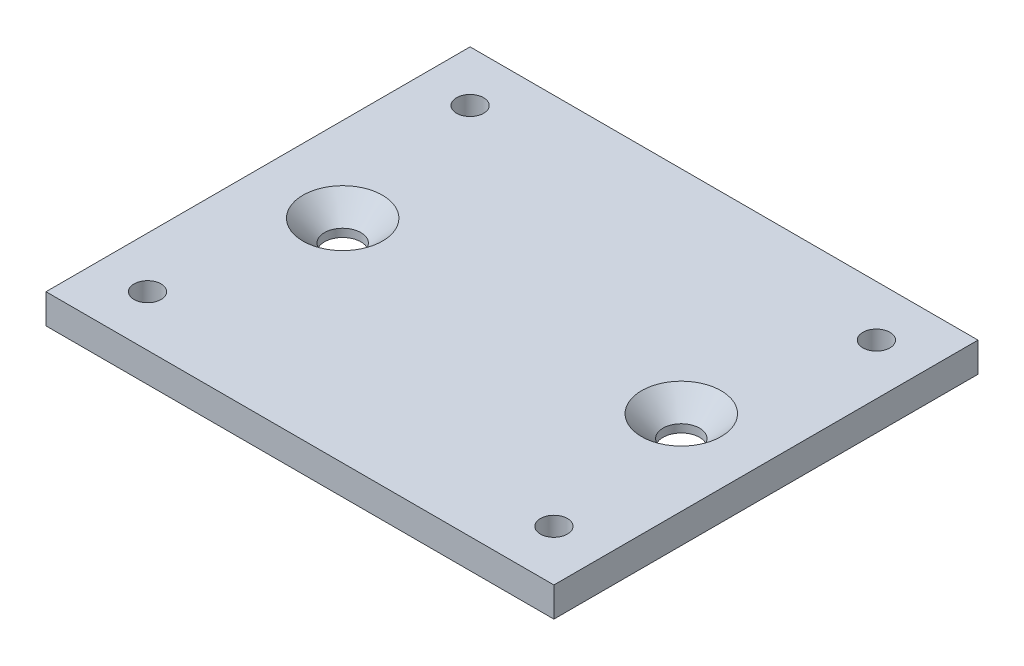
ISO-10303-21;
HEADER;
FILE_DESCRIPTION(('STEP AP214'),'2;1');
FILE_NAME('part.step','',(''),(''),'','','');
FILE_SCHEMA(('AUTOMOTIVE_DESIGN { 1 0 10303 214 1 1 1 1 }'));
ENDSEC;
DATA;
#1=APPLICATION_CONTEXT('core data for automotive mechanical design processes');
#2=APPLICATION_PROTOCOL_DEFINITION('international standard','automotive_design',2000,#1);
#3=PRODUCT_CONTEXT('',#1,'mechanical');
#4=PRODUCT('Part','Part','',(#3));
#5=PRODUCT_RELATED_PRODUCT_CATEGORY('part','',(#4));
#6=PRODUCT_DEFINITION_FORMATION('','',#4);
#7=PRODUCT_DEFINITION_CONTEXT('part definition',#1,'design');
#8=PRODUCT_DEFINITION('design','',#6,#7);
#9=PRODUCT_DEFINITION_SHAPE('','',#8);
#10=(LENGTH_UNIT() NAMED_UNIT(*) SI_UNIT(.MILLI.,.METRE.));
#11=(NAMED_UNIT(*) PLANE_ANGLE_UNIT() SI_UNIT($,.RADIAN.));
#12=(NAMED_UNIT(*) SI_UNIT($,.STERADIAN.) SOLID_ANGLE_UNIT());
#13=UNCERTAINTY_MEASURE_WITH_UNIT(LENGTH_MEASURE(1.E-05),#10,'distance_accuracy_value','');
#14=(GEOMETRIC_REPRESENTATION_CONTEXT(3) GLOBAL_UNCERTAINTY_ASSIGNED_CONTEXT((#13)) GLOBAL_UNIT_ASSIGNED_CONTEXT((#10,
#11,#12)) REPRESENTATION_CONTEXT('',''));
#15=CARTESIAN_POINT('',(0.,0.,0.));
#16=DIRECTION('',(0.,0.,1.));
#17=DIRECTION('',(1.,0.,0.));
#18=AXIS2_PLACEMENT_3D('',#15,#16,#17);
#19=CARTESIAN_POINT('',(30.,3.5,0.));
#20=DIRECTION('',(1.,0.,0.));
#21=DIRECTION('',(0.,0.,-1.));
#22=AXIS2_PLACEMENT_3D('',#19,#20,#21);
#23=PLANE('',#22);
#24=DIRECTION('',(0.,0.,1.));
#25=VECTOR('',#24,1.);
#26=CARTESIAN_POINT('',(30.,0.,0.));
#27=LINE('',#26,#25);
#28=CARTESIAN_POINT('',(30.,0.,-25.05));
#29=VERTEX_POINT('',#28);
#30=CARTESIAN_POINT('',(30.,0.,25.05));
#31=VERTEX_POINT('',#30);
#32=EDGE_CURVE('E97',#29,#31,#27,.T.);
#33=ORIENTED_EDGE('',*,*,#32,.F.);
#34=DIRECTION('',(0.,-1.,0.));
#35=VECTOR('',#34,1.);
#36=CARTESIAN_POINT('',(30.,3.5,-25.05));
#37=LINE('',#36,#35);
#38=CARTESIAN_POINT('',(30.,3.5,-25.05));
#39=VERTEX_POINT('',#38);
#40=EDGE_CURVE('E11',#39,#29,#37,.T.);
#41=ORIENTED_EDGE('',*,*,#40,.F.);
#42=DIRECTION('',(0.,0.,1.));
#43=VECTOR('',#42,1.);
#44=CARTESIAN_POINT('',(30.,3.5,0.));
#45=LINE('',#44,#43);
#46=CARTESIAN_POINT('',(30.,3.5,25.05));
#47=VERTEX_POINT('',#46);
#48=EDGE_CURVE('E89',#39,#47,#45,.T.);
#49=ORIENTED_EDGE('',*,*,#48,.T.);
#50=DIRECTION('',(0.,-1.,0.));
#51=VECTOR('',#50,1.);
#52=CARTESIAN_POINT('',(30.,3.5,25.05));
#53=LINE('',#52,#51);
#54=EDGE_CURVE('E50',#47,#31,#53,.T.);
#55=ORIENTED_EDGE('',*,*,#54,.T.);
#56=EDGE_LOOP('',(#33,#41,#49,#55));
#57=FACE_BOUND('',#56,.T.);
#58=ADVANCED_FACE('F34',(#57),#23,.T.);
#59=CARTESIAN_POINT('',(0.,3.5,-25.05));
#60=DIRECTION('',(0.,0.,-1.));
#61=DIRECTION('',(-1.,0.,0.));
#62=AXIS2_PLACEMENT_3D('',#59,#60,#61);
#63=PLANE('',#62);
#64=DIRECTION('',(1.,0.,0.));
#65=VECTOR('',#64,1.);
#66=CARTESIAN_POINT('',(0.,0.,-25.05));
#67=LINE('',#66,#65);
#68=CARTESIAN_POINT('',(-30.,0.,-25.05));
#69=VERTEX_POINT('',#68);
#70=EDGE_CURVE('E80',#69,#29,#67,.T.);
#71=ORIENTED_EDGE('',*,*,#70,.F.);
#72=DIRECTION('',(0.,-1.,0.));
#73=VECTOR('',#72,1.);
#74=CARTESIAN_POINT('',(-30.,3.5,-25.05));
#75=LINE('',#74,#73);
#76=CARTESIAN_POINT('',(-30.,3.5,-25.05));
#77=VERTEX_POINT('',#76);
#78=EDGE_CURVE('E42',#77,#69,#75,.T.);
#79=ORIENTED_EDGE('',*,*,#78,.F.);
#80=DIRECTION('',(1.,0.,0.));
#81=VECTOR('',#80,1.);
#82=CARTESIAN_POINT('',(0.,3.5,-25.05));
#83=LINE('',#82,#81);
#84=EDGE_CURVE('E78',#77,#39,#83,.T.);
#85=ORIENTED_EDGE('',*,*,#84,.T.);
#86=ORIENTED_EDGE('',*,*,#40,.T.);
#87=EDGE_LOOP('',(#71,#79,#85,#86));
#88=FACE_BOUND('',#87,.T.);
#89=ADVANCED_FACE('F77',(#88),#63,.T.);
#90=CARTESIAN_POINT('',(-30.,3.5,0.));
#91=DIRECTION('',(-1.,0.,0.));
#92=DIRECTION('',(0.,0.,1.));
#93=AXIS2_PLACEMENT_3D('',#90,#91,#92);
#94=PLANE('',#93);
#95=DIRECTION('',(0.,0.,-1.));
#96=VECTOR('',#95,1.);
#97=CARTESIAN_POINT('',(-30.,0.,0.));
#98=LINE('',#97,#96);
#99=CARTESIAN_POINT('',(-30.,0.,25.05));
#100=VERTEX_POINT('',#99);
#101=EDGE_CURVE('E101',#100,#69,#98,.T.);
#102=ORIENTED_EDGE('',*,*,#101,.F.);
#103=DIRECTION('',(0.,-1.,0.));
#104=VECTOR('',#103,1.);
#105=CARTESIAN_POINT('',(-30.,3.5,25.05));
#106=LINE('',#105,#104);
#107=CARTESIAN_POINT('',(-30.,3.5,25.05));
#108=VERTEX_POINT('',#107);
#109=EDGE_CURVE('E63',#108,#100,#106,.T.);
#110=ORIENTED_EDGE('',*,*,#109,.F.);
#111=DIRECTION('',(0.,0.,-1.));
#112=VECTOR('',#111,1.);
#113=CARTESIAN_POINT('',(-30.,3.5,0.));
#114=LINE('',#113,#112);
#115=EDGE_CURVE('E88',#108,#77,#114,.T.);
#116=ORIENTED_EDGE('',*,*,#115,.T.);
#117=ORIENTED_EDGE('',*,*,#78,.T.);
#118=EDGE_LOOP('',(#102,#110,#116,#117));
#119=FACE_BOUND('',#118,.T.);
#120=ADVANCED_FACE('F91',(#119),#94,.T.);
#121=CARTESIAN_POINT('',(0.,3.5,25.05));
#122=DIRECTION('',(0.,0.,1.));
#123=DIRECTION('',(1.,0.,0.));
#124=AXIS2_PLACEMENT_3D('',#121,#122,#123);
#125=PLANE('',#124);
#126=DIRECTION('',(-1.,0.,0.));
#127=VECTOR('',#126,1.);
#128=CARTESIAN_POINT('',(0.,0.,25.05));
#129=LINE('',#128,#127);
#130=EDGE_CURVE('E103',#31,#100,#129,.T.);
#131=ORIENTED_EDGE('',*,*,#130,.F.);
#132=ORIENTED_EDGE('',*,*,#54,.F.);
#133=DIRECTION('',(-1.,0.,0.));
#134=VECTOR('',#133,1.);
#135=CARTESIAN_POINT('',(0.,3.5,25.05));
#136=LINE('',#135,#134);
#137=EDGE_CURVE('E92',#47,#108,#136,.T.);
#138=ORIENTED_EDGE('',*,*,#137,.T.);
#139=ORIENTED_EDGE('',*,*,#109,.T.);
#140=EDGE_LOOP('',(#131,#132,#138,#139));
#141=FACE_BOUND('',#140,.T.);
#142=ADVANCED_FACE('F156',(#141),#125,.T.);
#143=CARTESIAN_POINT('',(0.,3.5,0.));
#144=DIRECTION('',(0.,1.,0.));
#145=DIRECTION('',(0.,0.,1.));
#146=AXIS2_PLACEMENT_3D('',#143,#144,#145);
#147=PLANE('',#146);
#148=CARTESIAN_POINT('',(-20.,3.5,0.));
#149=DIRECTION('',(0.,1.,0.));
#150=DIRECTION('',(0.,0.,1.));
#151=AXIS2_PLACEMENT_3D('',#148,#149,#150);
#152=CIRCLE('',#151,4.7);
#153=CARTESIAN_POINT('',(-20.,3.5,4.7));
#154=VERTEX_POINT('',#153);
#155=EDGE_CURVE('E147',#154,#154,#152,.T.);
#156=ORIENTED_EDGE('',*,*,#155,.F.);
#157=EDGE_LOOP('',(#156));
#158=FACE_BOUND('',#157,.T.);
#159=CARTESIAN_POINT('',(20.,3.5,0.));
#160=DIRECTION('',(0.,1.,0.));
#161=DIRECTION('',(0.,0.,1.));
#162=AXIS2_PLACEMENT_3D('',#159,#160,#161);
#163=CIRCLE('',#162,4.7);
#164=CARTESIAN_POINT('',(20.,3.5,4.7));
#165=VERTEX_POINT('',#164);
#166=EDGE_CURVE('E138',#165,#165,#163,.T.);
#167=ORIENTED_EDGE('',*,*,#166,.F.);
#168=EDGE_LOOP('',(#167));
#169=FACE_BOUND('',#168,.T.);
#170=CARTESIAN_POINT('',(-24.,3.5,-19.05));
#171=DIRECTION('',(0.,1.,0.));
#172=DIRECTION('',(0.,0.,1.));
#173=AXIS2_PLACEMENT_3D('',#170,#171,#172);
#174=CIRCLE('',#173,1.6);
#175=CARTESIAN_POINT('',(-24.,3.5,-17.45));
#176=VERTEX_POINT('',#175);
#177=EDGE_CURVE('E129',#176,#176,#174,.T.);
#178=ORIENTED_EDGE('',*,*,#177,.F.);
#179=EDGE_LOOP('',(#178));
#180=FACE_BOUND('',#179,.T.);
#181=CARTESIAN_POINT('',(24.,3.5,-19.05));
#182=DIRECTION('',(0.,1.,0.));
#183=DIRECTION('',(0.,0.,1.));
#184=AXIS2_PLACEMENT_3D('',#181,#182,#183);
#185=CIRCLE('',#184,1.6);
#186=CARTESIAN_POINT('',(24.,3.5,-17.45));
#187=VERTEX_POINT('',#186);
#188=EDGE_CURVE('E123',#187,#187,#185,.T.);
#189=ORIENTED_EDGE('',*,*,#188,.F.);
#190=EDGE_LOOP('',(#189));
#191=FACE_BOUND('',#190,.T.);
#192=CARTESIAN_POINT('',(24.,3.5,19.05));
#193=DIRECTION('',(0.,1.,0.));
#194=DIRECTION('',(0.,0.,1.));
#195=AXIS2_PLACEMENT_3D('',#192,#193,#194);
#196=CIRCLE('',#195,1.6);
#197=CARTESIAN_POINT('',(24.,3.5,20.65));
#198=VERTEX_POINT('',#197);
#199=EDGE_CURVE('E117',#198,#198,#196,.T.);
#200=ORIENTED_EDGE('',*,*,#199,.F.);
#201=EDGE_LOOP('',(#200));
#202=FACE_BOUND('',#201,.T.);
#203=CARTESIAN_POINT('',(-24.,3.5,19.05));
#204=DIRECTION('',(0.,1.,0.));
#205=DIRECTION('',(0.,0.,1.));
#206=AXIS2_PLACEMENT_3D('',#203,#204,#205);
#207=CIRCLE('',#206,1.6);
#208=CARTESIAN_POINT('',(-24.,3.5,20.65));
#209=VERTEX_POINT('',#208);
#210=EDGE_CURVE('E111',#209,#209,#207,.T.);
#211=ORIENTED_EDGE('',*,*,#210,.F.);
#212=EDGE_LOOP('',(#211));
#213=FACE_BOUND('',#212,.T.);
#214=ORIENTED_EDGE('',*,*,#48,.F.);
#215=ORIENTED_EDGE('',*,*,#84,.F.);
#216=ORIENTED_EDGE('',*,*,#115,.F.);
#217=ORIENTED_EDGE('',*,*,#137,.F.);
#218=EDGE_LOOP('',(#214,#215,#216,#217));
#219=FACE_BOUND('',#218,.T.);
#220=ADVANCED_FACE('F86',(#158,#169,#180,#191,#202,#213,#219),#147,.T.);
#221=CARTESIAN_POINT('',(0.,0.,0.));
#222=DIRECTION('',(0.,1.,0.));
#223=DIRECTION('',(0.,0.,1.));
#224=AXIS2_PLACEMENT_3D('',#221,#222,#223);
#225=PLANE('',#224);
#226=CARTESIAN_POINT('',(-20.,0.,0.));
#227=DIRECTION('',(0.,1.,0.));
#228=DIRECTION('',(0.,0.,1.));
#229=AXIS2_PLACEMENT_3D('',#226,#227,#228);
#230=CIRCLE('',#229,2.15);
#231=CARTESIAN_POINT('',(-20.,0.,2.15));
#232=VERTEX_POINT('',#231);
#233=EDGE_CURVE('E141',#232,#232,#230,.T.);
#234=ORIENTED_EDGE('',*,*,#233,.T.);
#235=EDGE_LOOP('',(#234));
#236=FACE_BOUND('',#235,.T.);
#237=CARTESIAN_POINT('',(20.,0.,0.));
#238=DIRECTION('',(0.,1.,0.));
#239=DIRECTION('',(0.,0.,1.));
#240=AXIS2_PLACEMENT_3D('',#237,#238,#239);
#241=CIRCLE('',#240,2.15);
#242=CARTESIAN_POINT('',(20.,0.,2.15));
#243=VERTEX_POINT('',#242);
#244=EDGE_CURVE('E132',#243,#243,#241,.T.);
#245=ORIENTED_EDGE('',*,*,#244,.T.);
#246=EDGE_LOOP('',(#245));
#247=FACE_BOUND('',#246,.T.);
#248=CARTESIAN_POINT('',(-24.,0.,-19.05));
#249=DIRECTION('',(0.,1.,0.));
#250=DIRECTION('',(0.,0.,1.));
#251=AXIS2_PLACEMENT_3D('',#248,#249,#250);
#252=CIRCLE('',#251,1.6);
#253=CARTESIAN_POINT('',(-24.,0.,-17.45));
#254=VERTEX_POINT('',#253);
#255=EDGE_CURVE('E126',#254,#254,#252,.T.);
#256=ORIENTED_EDGE('',*,*,#255,.T.);
#257=EDGE_LOOP('',(#256));
#258=FACE_BOUND('',#257,.T.);
#259=CARTESIAN_POINT('',(24.,0.,-19.05));
#260=DIRECTION('',(0.,1.,0.));
#261=DIRECTION('',(0.,0.,1.));
#262=AXIS2_PLACEMENT_3D('',#259,#260,#261);
#263=CIRCLE('',#262,1.6);
#264=CARTESIAN_POINT('',(24.,0.,-17.45));
#265=VERTEX_POINT('',#264);
#266=EDGE_CURVE('E120',#265,#265,#263,.T.);
#267=ORIENTED_EDGE('',*,*,#266,.T.);
#268=EDGE_LOOP('',(#267));
#269=FACE_BOUND('',#268,.T.);
#270=CARTESIAN_POINT('',(24.,0.,19.05));
#271=DIRECTION('',(0.,1.,0.));
#272=DIRECTION('',(0.,0.,1.));
#273=AXIS2_PLACEMENT_3D('',#270,#271,#272);
#274=CIRCLE('',#273,1.6);
#275=CARTESIAN_POINT('',(24.,0.,20.65));
#276=VERTEX_POINT('',#275);
#277=EDGE_CURVE('E114',#276,#276,#274,.T.);
#278=ORIENTED_EDGE('',*,*,#277,.T.);
#279=EDGE_LOOP('',(#278));
#280=FACE_BOUND('',#279,.T.);
#281=CARTESIAN_POINT('',(-24.,0.,19.05));
#282=DIRECTION('',(0.,1.,0.));
#283=DIRECTION('',(0.,0.,1.));
#284=AXIS2_PLACEMENT_3D('',#281,#282,#283);
#285=CIRCLE('',#284,1.6);
#286=CARTESIAN_POINT('',(-24.,0.,20.65));
#287=VERTEX_POINT('',#286);
#288=EDGE_CURVE('E99',#287,#287,#285,.T.);
#289=ORIENTED_EDGE('',*,*,#288,.T.);
#290=EDGE_LOOP('',(#289));
#291=FACE_BOUND('',#290,.T.);
#292=ORIENTED_EDGE('',*,*,#32,.T.);
#293=ORIENTED_EDGE('',*,*,#130,.T.);
#294=ORIENTED_EDGE('',*,*,#101,.T.);
#295=ORIENTED_EDGE('',*,*,#70,.T.);
#296=EDGE_LOOP('',(#292,#293,#294,#295));
#297=FACE_BOUND('',#296,.T.);
#298=ADVANCED_FACE('F155',(#236,#247,#258,#269,#280,#291,#297),#225,.F.);
#299=CARTESIAN_POINT('',(-24.,3.5,19.05));
#300=DIRECTION('',(0.,1.,0.));
#301=DIRECTION('',(0.,0.,1.));
#302=AXIS2_PLACEMENT_3D('',#299,#300,#301);
#303=CYLINDRICAL_SURFACE('',#302,1.6);
#304=ORIENTED_EDGE('',*,*,#288,.F.);
#305=EDGE_LOOP('',(#304));
#306=FACE_BOUND('',#305,.T.);
#307=ORIENTED_EDGE('',*,*,#210,.T.);
#308=EDGE_LOOP('',(#307));
#309=FACE_BOUND('',#308,.T.);
#310=ADVANCED_FACE('F168',(#306,#309),#303,.F.);
#311=CARTESIAN_POINT('',(24.,3.5,19.05));
#312=DIRECTION('',(0.,1.,0.));
#313=DIRECTION('',(0.,0.,1.));
#314=AXIS2_PLACEMENT_3D('',#311,#312,#313);
#315=CYLINDRICAL_SURFACE('',#314,1.6);
#316=ORIENTED_EDGE('',*,*,#277,.F.);
#317=EDGE_LOOP('',(#316));
#318=FACE_BOUND('',#317,.T.);
#319=ORIENTED_EDGE('',*,*,#199,.T.);
#320=EDGE_LOOP('',(#319));
#321=FACE_BOUND('',#320,.T.);
#322=ADVANCED_FACE('F170',(#318,#321),#315,.F.);
#323=CARTESIAN_POINT('',(24.,3.5,-19.05));
#324=DIRECTION('',(0.,1.,0.));
#325=DIRECTION('',(0.,0.,1.));
#326=AXIS2_PLACEMENT_3D('',#323,#324,#325);
#327=CYLINDRICAL_SURFACE('',#326,1.6);
#328=ORIENTED_EDGE('',*,*,#266,.F.);
#329=EDGE_LOOP('',(#328));
#330=FACE_BOUND('',#329,.T.);
#331=ORIENTED_EDGE('',*,*,#188,.T.);
#332=EDGE_LOOP('',(#331));
#333=FACE_BOUND('',#332,.T.);
#334=ADVANCED_FACE('F177',(#330,#333),#327,.F.);
#335=CARTESIAN_POINT('',(-24.,3.5,-19.05));
#336=DIRECTION('',(0.,1.,0.));
#337=DIRECTION('',(0.,0.,1.));
#338=AXIS2_PLACEMENT_3D('',#335,#336,#337);
#339=CYLINDRICAL_SURFACE('',#338,1.6);
#340=ORIENTED_EDGE('',*,*,#255,.F.);
#341=EDGE_LOOP('',(#340));
#342=FACE_BOUND('',#341,.T.);
#343=ORIENTED_EDGE('',*,*,#177,.T.);
#344=EDGE_LOOP('',(#343));
#345=FACE_BOUND('',#344,.T.);
#346=ADVANCED_FACE('F282',(#342,#345),#339,.F.);
#347=CARTESIAN_POINT('',(20.,3.5,0.));
#348=DIRECTION('',(0.,1.,0.));
#349=DIRECTION('',(0.,0.,1.));
#350=AXIS2_PLACEMENT_3D('',#347,#348,#349);
#351=CYLINDRICAL_SURFACE('',#350,2.15);
#352=ORIENTED_EDGE('',*,*,#244,.F.);
#353=EDGE_LOOP('',(#352));
#354=FACE_BOUND('',#353,.T.);
#355=CARTESIAN_POINT('',(20.,0.950000000000002,0.));
#356=DIRECTION('',(0.,1.,0.));
#357=DIRECTION('',(0.,0.,1.));
#358=AXIS2_PLACEMENT_3D('',#355,#356,#357);
#359=CIRCLE('',#358,2.15);
#360=CARTESIAN_POINT('',(20.,0.950000000000002,2.15));
#361=VERTEX_POINT('',#360);
#362=EDGE_CURVE('E135',#361,#361,#359,.T.);
#363=ORIENTED_EDGE('',*,*,#362,.T.);
#364=EDGE_LOOP('',(#363));
#365=FACE_BOUND('',#364,.T.);
#366=ADVANCED_FACE('F290',(#354,#365),#351,.F.);
#367=CARTESIAN_POINT('',(20.,3.5,0.));
#368=DIRECTION('',(0.,1.,0.));
#369=DIRECTION('',(0.,0.,1.));
#370=AXIS2_PLACEMENT_3D('',#367,#368,#369);
#371=CONICAL_SURFACE('',#370,4.7,0.785398163397449);
#372=ORIENTED_EDGE('',*,*,#362,.F.);
#373=EDGE_LOOP('',(#372));
#374=FACE_BOUND('',#373,.T.);
#375=ORIENTED_EDGE('',*,*,#166,.T.);
#376=EDGE_LOOP('',(#375));
#377=FACE_BOUND('',#376,.T.);
#378=ADVANCED_FACE('F298',(#374,#377),#371,.F.);
#379=CARTESIAN_POINT('',(-20.,3.5,0.));
#380=DIRECTION('',(0.,1.,0.));
#381=DIRECTION('',(0.,0.,1.));
#382=AXIS2_PLACEMENT_3D('',#379,#380,#381);
#383=CYLINDRICAL_SURFACE('',#382,2.15);
#384=ORIENTED_EDGE('',*,*,#233,.F.);
#385=EDGE_LOOP('',(#384));
#386=FACE_BOUND('',#385,.T.);
#387=CARTESIAN_POINT('',(-20.,0.950000000000002,0.));
#388=DIRECTION('',(0.,1.,0.));
#389=DIRECTION('',(0.,0.,1.));
#390=AXIS2_PLACEMENT_3D('',#387,#388,#389);
#391=CIRCLE('',#390,2.15);
#392=CARTESIAN_POINT('',(-20.,0.950000000000002,2.15));
#393=VERTEX_POINT('',#392);
#394=EDGE_CURVE('E144',#393,#393,#391,.T.);
#395=ORIENTED_EDGE('',*,*,#394,.T.);
#396=EDGE_LOOP('',(#395));
#397=FACE_BOUND('',#396,.T.);
#398=ADVANCED_FACE('F307',(#386,#397),#383,.F.);
#399=CARTESIAN_POINT('',(-20.,3.5,0.));
#400=DIRECTION('',(0.,1.,0.));
#401=DIRECTION('',(0.,0.,1.));
#402=AXIS2_PLACEMENT_3D('',#399,#400,#401);
#403=CONICAL_SURFACE('',#402,4.7,0.785398163397449);
#404=ORIENTED_EDGE('',*,*,#394,.F.);
#405=EDGE_LOOP('',(#404));
#406=FACE_BOUND('',#405,.T.);
#407=ORIENTED_EDGE('',*,*,#155,.T.);
#408=EDGE_LOOP('',(#407));
#409=FACE_BOUND('',#408,.T.);
#410=ADVANCED_FACE('F151',(#406,#409),#403,.F.);
#411=CLOSED_SHELL('',(#58,#89,#120,#142,#220,#298,#310,#322,#334,#346,#366,#378,#398,#410));
#412=MANIFOLD_SOLID_BREP('B2',#411);
#413=ADVANCED_BREP_SHAPE_REPRESENTATION('',(#18,#412),#14);
#414=SHAPE_DEFINITION_REPRESENTATION(#9,#413);
ENDSEC;
END-ISO-10303-21;
